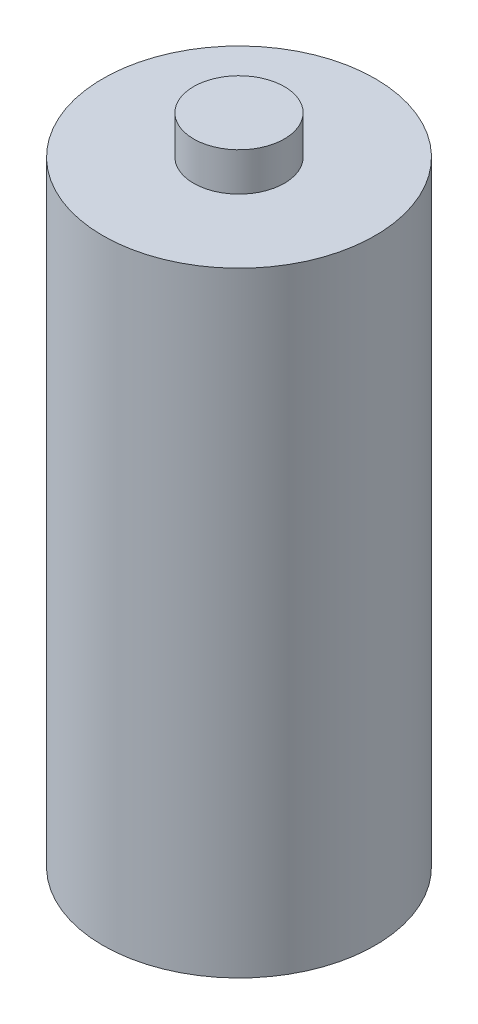
ISO-10303-21;
HEADER;
FILE_DESCRIPTION(('STEP AP214'),'2;1');
FILE_NAME('part.step','',(''),(''),'','','');
FILE_SCHEMA(('AUTOMOTIVE_DESIGN { 1 0 10303 214 1 1 1 1 }'));
ENDSEC;
DATA;
#1=APPLICATION_CONTEXT('core data for automotive mechanical design processes');
#2=APPLICATION_PROTOCOL_DEFINITION('international standard','automotive_design',2000,#1);
#3=PRODUCT_CONTEXT('',#1,'mechanical');
#4=PRODUCT('Part','Part','',(#3));
#5=PRODUCT_RELATED_PRODUCT_CATEGORY('part','',(#4));
#6=PRODUCT_DEFINITION_FORMATION('','',#4);
#7=PRODUCT_DEFINITION_CONTEXT('part definition',#1,'design');
#8=PRODUCT_DEFINITION('design','',#6,#7);
#9=PRODUCT_DEFINITION_SHAPE('','',#8);
#10=(LENGTH_UNIT() NAMED_UNIT(*) SI_UNIT(.MILLI.,.METRE.));
#11=(NAMED_UNIT(*) PLANE_ANGLE_UNIT() SI_UNIT($,.RADIAN.));
#12=(NAMED_UNIT(*) SI_UNIT($,.STERADIAN.) SOLID_ANGLE_UNIT());
#13=UNCERTAINTY_MEASURE_WITH_UNIT(LENGTH_MEASURE(1.E-05),#10,'distance_accuracy_value','');
#14=(GEOMETRIC_REPRESENTATION_CONTEXT(3) GLOBAL_UNCERTAINTY_ASSIGNED_CONTEXT((#13)) GLOBAL_UNIT_ASSIGNED_CONTEXT((#10,
#11,#12)) REPRESENTATION_CONTEXT('',''));
#15=CARTESIAN_POINT('',(0.,0.,0.));
#16=DIRECTION('',(0.,0.,1.));
#17=DIRECTION('',(1.,0.,0.));
#18=AXIS2_PLACEMENT_3D('',#15,#16,#17);
#19=CARTESIAN_POINT('',(0.,57.15,0.));
#20=DIRECTION('',(0.,-1.,0.));
#21=DIRECTION('',(0.,0.,-1.));
#22=AXIS2_PLACEMENT_3D('',#19,#20,#21);
#23=CYLINDRICAL_SURFACE('',#22,7.5);
#24=CARTESIAN_POINT('',(0.,50.8,0.));
#25=DIRECTION('',(0.,1.,0.));
#26=DIRECTION('',(0.,0.,1.));
#27=AXIS2_PLACEMENT_3D('',#24,#25,#26);
#28=CIRCLE('',#27,7.5);
#29=CARTESIAN_POINT('',(0.,50.8,7.5));
#30=VERTEX_POINT('',#29);
#31=EDGE_CURVE('E34',#30,#30,#28,.T.);
#32=ORIENTED_EDGE('',*,*,#31,.T.);
#33=EDGE_LOOP('',(#32));
#34=FACE_BOUND('',#33,.T.);
#35=CARTESIAN_POINT('',(0.,57.15,0.));
#36=DIRECTION('',(0.,1.,0.));
#37=DIRECTION('',(0.,0.,1.));
#38=AXIS2_PLACEMENT_3D('',#35,#36,#37);
#39=CIRCLE('',#38,7.5);
#40=CARTESIAN_POINT('',(0.,57.15,7.5));
#41=VERTEX_POINT('',#40);
#42=EDGE_CURVE('E38',#41,#41,#39,.T.);
#43=ORIENTED_EDGE('',*,*,#42,.F.);
#44=EDGE_LOOP('',(#43));
#45=FACE_BOUND('',#44,.T.);
#46=ADVANCED_FACE('F31',(#34,#45),#23,.T.);
#47=CARTESIAN_POINT('',(0.,57.15,0.));
#48=DIRECTION('',(0.,1.,0.));
#49=DIRECTION('',(0.,0.,1.));
#50=AXIS2_PLACEMENT_3D('',#47,#48,#49);
#51=PLANE('',#50);
#52=ORIENTED_EDGE('',*,*,#42,.T.);
#53=EDGE_LOOP('',(#52));
#54=FACE_BOUND('',#53,.T.);
#55=ADVANCED_FACE('F70',(#54),#51,.T.);
#56=CARTESIAN_POINT('',(0.,50.8,0.));
#57=DIRECTION('',(0.,-1.,0.));
#58=DIRECTION('',(0.,0.,-1.));
#59=AXIS2_PLACEMENT_3D('',#56,#57,#58);
#60=CYLINDRICAL_SURFACE('',#59,22.5);
#61=CARTESIAN_POINT('',(0.,50.8,0.));
#62=DIRECTION('',(0.,1.,0.));
#63=DIRECTION('',(0.,0.,1.));
#64=AXIS2_PLACEMENT_3D('',#61,#62,#63);
#65=CIRCLE('',#64,22.5);
#66=CARTESIAN_POINT('',(0.,50.8,22.5));
#67=VERTEX_POINT('',#66);
#68=EDGE_CURVE('E50',#67,#67,#65,.T.);
#69=ORIENTED_EDGE('',*,*,#68,.F.);
#70=EDGE_LOOP('',(#69));
#71=FACE_BOUND('',#70,.T.);
#72=CARTESIAN_POINT('',(0.,-50.8,0.));
#73=DIRECTION('',(0.,1.,0.));
#74=DIRECTION('',(0.,0.,1.));
#75=AXIS2_PLACEMENT_3D('',#72,#73,#74);
#76=CIRCLE('',#75,22.5);
#77=CARTESIAN_POINT('',(0.,-50.8,22.5));
#78=VERTEX_POINT('',#77);
#79=EDGE_CURVE('E47',#78,#78,#76,.T.);
#80=ORIENTED_EDGE('',*,*,#79,.T.);
#81=EDGE_LOOP('',(#80));
#82=FACE_BOUND('',#81,.T.);
#83=ADVANCED_FACE('F62',(#71,#82),#60,.T.);
#84=CARTESIAN_POINT('',(0.,50.8,0.));
#85=DIRECTION('',(0.,1.,0.));
#86=DIRECTION('',(0.,0.,1.));
#87=AXIS2_PLACEMENT_3D('',#84,#85,#86);
#88=PLANE('',#87);
#89=ORIENTED_EDGE('',*,*,#31,.F.);
#90=EDGE_LOOP('',(#89));
#91=FACE_BOUND('',#90,.T.);
#92=ORIENTED_EDGE('',*,*,#68,.T.);
#93=EDGE_LOOP('',(#92));
#94=FACE_BOUND('',#93,.T.);
#95=ADVANCED_FACE('F59',(#91,#94),#88,.T.);
#96=CARTESIAN_POINT('',(0.,-50.8,0.));
#97=DIRECTION('',(0.,1.,0.));
#98=DIRECTION('',(0.,0.,1.));
#99=AXIS2_PLACEMENT_3D('',#96,#97,#98);
#100=PLANE('',#99);
#101=CARTESIAN_POINT('',(0.,-50.8,0.));
#102=DIRECTION('',(0.,1.,0.));
#103=DIRECTION('',(0.,0.,1.));
#104=AXIS2_PLACEMENT_3D('',#101,#102,#103);
#105=CIRCLE('',#104,7.5);
#106=CARTESIAN_POINT('',(0.,-50.8,7.5));
#107=VERTEX_POINT('',#106);
#108=EDGE_CURVE('E10',#107,#107,#105,.T.);
#109=ORIENTED_EDGE('',*,*,#108,.T.);
#110=EDGE_LOOP('',(#109));
#111=FACE_BOUND('',#110,.T.);
#112=ORIENTED_EDGE('',*,*,#79,.F.);
#113=EDGE_LOOP('',(#112));
#114=FACE_BOUND('',#113,.T.);
#115=ADVANCED_FACE('F61',(#111,#114),#100,.F.);
#116=CARTESIAN_POINT('',(0.,-57.15,0.));
#117=DIRECTION('',(0.,1.,0.));
#118=DIRECTION('',(0.,0.,1.));
#119=AXIS2_PLACEMENT_3D('',#116,#117,#118);
#120=PLANE('',#119);
#121=CARTESIAN_POINT('',(0.,-57.15,0.));
#122=DIRECTION('',(0.,1.,0.));
#123=DIRECTION('',(0.,0.,1.));
#124=AXIS2_PLACEMENT_3D('',#121,#122,#123);
#125=CIRCLE('',#124,7.5);
#126=CARTESIAN_POINT('',(0.,-57.15,7.5));
#127=VERTEX_POINT('',#126);
#128=EDGE_CURVE('E42',#127,#127,#125,.T.);
#129=ORIENTED_EDGE('',*,*,#128,.F.);
#130=EDGE_LOOP('',(#129));
#131=FACE_BOUND('',#130,.T.);
#132=ADVANCED_FACE('F68',(#131),#120,.F.);
#133=ORIENTED_EDGE('',*,*,#128,.T.);
#134=EDGE_LOOP('',(#133));
#135=FACE_BOUND('',#134,.T.);
#136=ORIENTED_EDGE('',*,*,#108,.F.);
#137=EDGE_LOOP('',(#136));
#138=FACE_BOUND('',#137,.T.);
#139=ADVANCED_FACE('F74',(#135,#138),#23,.T.);
#140=CLOSED_SHELL('',(#46,#55,#83,#95,#115,#132,#139));
#141=MANIFOLD_SOLID_BREP('B2',#140);
#142=ADVANCED_BREP_SHAPE_REPRESENTATION('',(#18,#141),#14);
#143=SHAPE_DEFINITION_REPRESENTATION(#9,#142);
ENDSEC;
END-ISO-10303-21;
